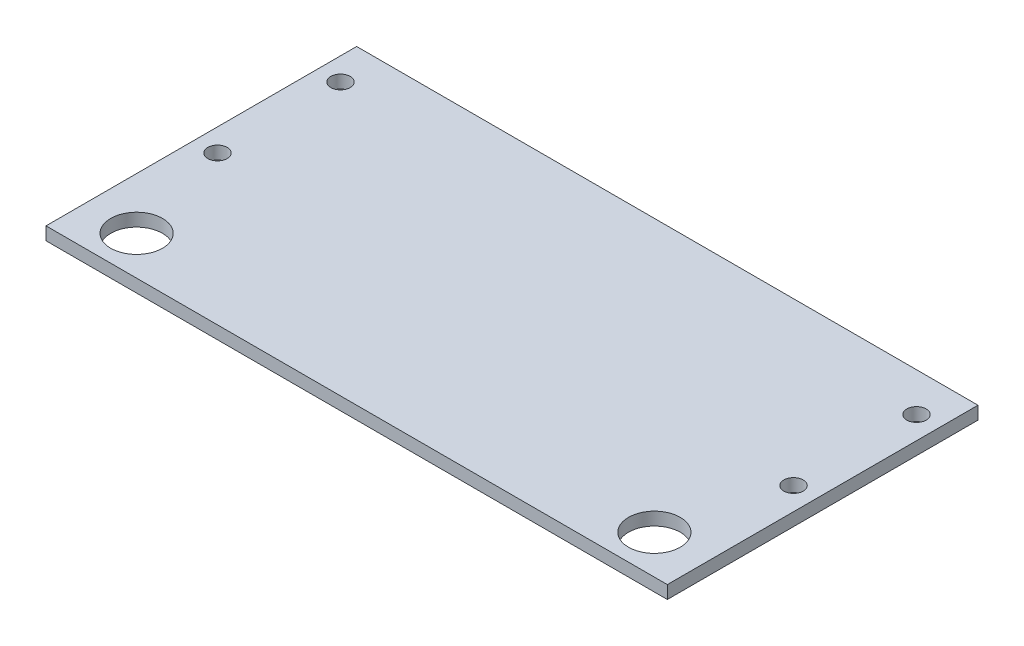
ISO-10303-21;
HEADER;
FILE_DESCRIPTION(('STEP AP214'),'2;1');
FILE_NAME('part.step','',(''),(''),'','','');
FILE_SCHEMA(('AUTOMOTIVE_DESIGN { 1 0 10303 214 1 1 1 1 }'));
ENDSEC;
DATA;
#1=APPLICATION_CONTEXT('core data for automotive mechanical design processes');
#2=APPLICATION_PROTOCOL_DEFINITION('international standard','automotive_design',2000,#1);
#3=PRODUCT_CONTEXT('',#1,'mechanical');
#4=PRODUCT('Part','Part','',(#3));
#5=PRODUCT_RELATED_PRODUCT_CATEGORY('part','',(#4));
#6=PRODUCT_DEFINITION_FORMATION('','',#4);
#7=PRODUCT_DEFINITION_CONTEXT('part definition',#1,'design');
#8=PRODUCT_DEFINITION('design','',#6,#7);
#9=PRODUCT_DEFINITION_SHAPE('','',#8);
#10=(LENGTH_UNIT() NAMED_UNIT(*) SI_UNIT(.MILLI.,.METRE.));
#11=(NAMED_UNIT(*) PLANE_ANGLE_UNIT() SI_UNIT($,.RADIAN.));
#12=(NAMED_UNIT(*) SI_UNIT($,.STERADIAN.) SOLID_ANGLE_UNIT());
#13=UNCERTAINTY_MEASURE_WITH_UNIT(LENGTH_MEASURE(1.E-05),#10,'distance_accuracy_value','');
#14=(GEOMETRIC_REPRESENTATION_CONTEXT(3) GLOBAL_UNCERTAINTY_ASSIGNED_CONTEXT((#13)) GLOBAL_UNIT_ASSIGNED_CONTEXT((#10,
#11,#12)) REPRESENTATION_CONTEXT('',''));
#15=CARTESIAN_POINT('',(0.,0.,0.));
#16=DIRECTION('',(0.,0.,1.));
#17=DIRECTION('',(1.,0.,0.));
#18=AXIS2_PLACEMENT_3D('',#15,#16,#17);
#19=CARTESIAN_POINT('',(0.,6.35,0.));
#20=DIRECTION('',(1.,0.,0.));
#21=DIRECTION('',(0.,0.,-1.));
#22=AXIS2_PLACEMENT_3D('',#19,#20,#21);
#23=PLANE('',#22);
#24=DIRECTION('',(0.,0.,1.));
#25=VECTOR('',#24,1.);
#26=CARTESIAN_POINT('',(0.,0.,0.));
#27=LINE('',#26,#25);
#28=CARTESIAN_POINT('',(0.,0.,-152.4));
#29=VERTEX_POINT('',#28);
#30=CARTESIAN_POINT('',(0.,0.,0.));
#31=VERTEX_POINT('',#30);
#32=EDGE_CURVE('E97',#29,#31,#27,.T.);
#33=ORIENTED_EDGE('',*,*,#32,.T.);
#34=DIRECTION('',(0.,-1.,0.));
#35=VECTOR('',#34,1.);
#36=CARTESIAN_POINT('',(0.,6.35,0.));
#37=LINE('',#36,#35);
#38=CARTESIAN_POINT('',(0.,6.35,0.));
#39=VERTEX_POINT('',#38);
#40=EDGE_CURVE('E11',#39,#31,#37,.T.);
#41=ORIENTED_EDGE('',*,*,#40,.F.);
#42=DIRECTION('',(0.,0.,1.));
#43=VECTOR('',#42,1.);
#44=CARTESIAN_POINT('',(0.,6.35,0.));
#45=LINE('',#44,#43);
#46=CARTESIAN_POINT('',(0.,6.35,-152.4));
#47=VERTEX_POINT('',#46);
#48=EDGE_CURVE('E85',#47,#39,#45,.T.);
#49=ORIENTED_EDGE('',*,*,#48,.F.);
#50=DIRECTION('',(0.,-1.,0.));
#51=VECTOR('',#50,1.);
#52=CARTESIAN_POINT('',(0.,6.35,-152.4));
#53=LINE('',#52,#51);
#54=EDGE_CURVE('E93',#47,#29,#53,.T.);
#55=ORIENTED_EDGE('',*,*,#54,.T.);
#56=EDGE_LOOP('',(#33,#41,#49,#55));
#57=FACE_BOUND('',#56,.T.);
#58=ADVANCED_FACE('F34',(#57),#23,.F.);
#59=CARTESIAN_POINT('',(0.,6.35,0.));
#60=DIRECTION('',(0.,0.,-1.));
#61=DIRECTION('',(-1.,0.,0.));
#62=AXIS2_PLACEMENT_3D('',#59,#60,#61);
#63=PLANE('',#62);
#64=DIRECTION('',(1.,0.,0.));
#65=VECTOR('',#64,1.);
#66=CARTESIAN_POINT('',(0.,0.,0.));
#67=LINE('',#66,#65);
#68=CARTESIAN_POINT('',(304.8,0.,0.));
#69=VERTEX_POINT('',#68);
#70=EDGE_CURVE('E89',#31,#69,#67,.T.);
#71=ORIENTED_EDGE('',*,*,#70,.T.);
#72=DIRECTION('',(0.,-1.,0.));
#73=VECTOR('',#72,1.);
#74=CARTESIAN_POINT('',(304.8,6.35,0.));
#75=LINE('',#74,#73);
#76=CARTESIAN_POINT('',(304.8,6.35,0.));
#77=VERTEX_POINT('',#76);
#78=EDGE_CURVE('E42',#77,#69,#75,.T.);
#79=ORIENTED_EDGE('',*,*,#78,.F.);
#80=DIRECTION('',(1.,0.,0.));
#81=VECTOR('',#80,1.);
#82=CARTESIAN_POINT('',(0.,6.35,0.));
#83=LINE('',#82,#81);
#84=EDGE_CURVE('E80',#39,#77,#83,.T.);
#85=ORIENTED_EDGE('',*,*,#84,.F.);
#86=ORIENTED_EDGE('',*,*,#40,.T.);
#87=EDGE_LOOP('',(#71,#79,#85,#86));
#88=FACE_BOUND('',#87,.T.);
#89=ADVANCED_FACE('F88',(#88),#63,.F.);
#90=CARTESIAN_POINT('',(304.8,6.35,0.));
#91=DIRECTION('',(-1.,0.,0.));
#92=DIRECTION('',(0.,0.,1.));
#93=AXIS2_PLACEMENT_3D('',#90,#91,#92);
#94=PLANE('',#93);
#95=DIRECTION('',(0.,0.,-1.));
#96=VECTOR('',#95,1.);
#97=CARTESIAN_POINT('',(304.8,0.,0.));
#98=LINE('',#97,#96);
#99=CARTESIAN_POINT('',(304.8,0.,-152.4));
#100=VERTEX_POINT('',#99);
#101=EDGE_CURVE('E67',#69,#100,#98,.T.);
#102=ORIENTED_EDGE('',*,*,#101,.T.);
#103=DIRECTION('',(0.,-1.,0.));
#104=VECTOR('',#103,1.);
#105=CARTESIAN_POINT('',(304.8,6.35,-152.4));
#106=LINE('',#105,#104);
#107=CARTESIAN_POINT('',(304.8,6.35,-152.4));
#108=VERTEX_POINT('',#107);
#109=EDGE_CURVE('E90',#108,#100,#106,.T.);
#110=ORIENTED_EDGE('',*,*,#109,.F.);
#111=DIRECTION('',(0.,0.,-1.));
#112=VECTOR('',#111,1.);
#113=CARTESIAN_POINT('',(304.8,6.35,0.));
#114=LINE('',#113,#112);
#115=EDGE_CURVE('E83',#77,#108,#114,.T.);
#116=ORIENTED_EDGE('',*,*,#115,.F.);
#117=ORIENTED_EDGE('',*,*,#78,.T.);
#118=EDGE_LOOP('',(#102,#110,#116,#117));
#119=FACE_BOUND('',#118,.T.);
#120=ADVANCED_FACE('F91',(#119),#94,.F.);
#121=CARTESIAN_POINT('',(0.,6.35,-152.4));
#122=DIRECTION('',(0.,0.,1.));
#123=DIRECTION('',(1.,0.,0.));
#124=AXIS2_PLACEMENT_3D('',#121,#122,#123);
#125=PLANE('',#124);
#126=DIRECTION('',(-1.,0.,0.));
#127=VECTOR('',#126,1.);
#128=CARTESIAN_POINT('',(0.,0.,-152.4));
#129=LINE('',#128,#127);
#130=EDGE_CURVE('E73',#100,#29,#129,.T.);
#131=ORIENTED_EDGE('',*,*,#130,.T.);
#132=ORIENTED_EDGE('',*,*,#54,.F.);
#133=DIRECTION('',(-1.,0.,0.));
#134=VECTOR('',#133,1.);
#135=CARTESIAN_POINT('',(0.,6.35,-152.4));
#136=LINE('',#135,#134);
#137=EDGE_CURVE('E50',#108,#47,#136,.T.);
#138=ORIENTED_EDGE('',*,*,#137,.F.);
#139=ORIENTED_EDGE('',*,*,#109,.T.);
#140=EDGE_LOOP('',(#131,#132,#138,#139));
#141=FACE_BOUND('',#140,.T.);
#142=ADVANCED_FACE('F105',(#141),#125,.F.);
#143=CARTESIAN_POINT('',(0.,6.35,-152.4));
#144=DIRECTION('',(0.,-1.,0.));
#145=DIRECTION('',(0.,0.,-1.));
#146=AXIS2_PLACEMENT_3D('',#143,#144,#145);
#147=PLANE('',#146);
#148=CARTESIAN_POINT('',(279.4,6.35,-19.0499999999999));
#149=DIRECTION('',(0.,1.,0.));
#150=DIRECTION('',(0.,0.,-1.));
#151=AXIS2_PLACEMENT_3D('',#148,#149,#150);
#152=CIRCLE('',#151,12.7);
#153=CARTESIAN_POINT('',(279.4,6.35,-31.7499999999999));
#154=VERTEX_POINT('',#153);
#155=EDGE_CURVE('E138',#154,#154,#152,.T.);
#156=ORIENTED_EDGE('',*,*,#155,.F.);
#157=EDGE_LOOP('',(#156));
#158=FACE_BOUND('',#157,.T.);
#159=CARTESIAN_POINT('',(293.6875,6.35,-73.025));
#160=DIRECTION('',(0.,1.,0.));
#161=DIRECTION('',(0.,0.,-1.));
#162=AXIS2_PLACEMENT_3D('',#159,#160,#161);
#163=CIRCLE('',#162,4.76250000000001);
#164=CARTESIAN_POINT('',(293.6875,6.35,-77.7875));
#165=VERTEX_POINT('',#164);
#166=EDGE_CURVE('E132',#165,#165,#163,.T.);
#167=ORIENTED_EDGE('',*,*,#166,.F.);
#168=EDGE_LOOP('',(#167));
#169=FACE_BOUND('',#168,.T.);
#170=CARTESIAN_POINT('',(293.6875,6.35,-133.35));
#171=DIRECTION('',(0.,1.,0.));
#172=DIRECTION('',(0.,0.,-1.));
#173=AXIS2_PLACEMENT_3D('',#170,#171,#172);
#174=CIRCLE('',#173,4.76250000000001);
#175=CARTESIAN_POINT('',(293.6875,6.35,-138.1125));
#176=VERTEX_POINT('',#175);
#177=EDGE_CURVE('E126',#176,#176,#174,.T.);
#178=ORIENTED_EDGE('',*,*,#177,.F.);
#179=EDGE_LOOP('',(#178));
#180=FACE_BOUND('',#179,.T.);
#181=CARTESIAN_POINT('',(11.1125,6.35,-73.025));
#182=DIRECTION('',(0.,1.,0.));
#183=DIRECTION('',(0.,0.,1.));
#184=AXIS2_PLACEMENT_3D('',#181,#182,#183);
#185=CIRCLE('',#184,4.7625);
#186=CARTESIAN_POINT('',(11.1125,6.35,-68.2625));
#187=VERTEX_POINT('',#186);
#188=EDGE_CURVE('E120',#187,#187,#185,.T.);
#189=ORIENTED_EDGE('',*,*,#188,.F.);
#190=EDGE_LOOP('',(#189));
#191=FACE_BOUND('',#190,.T.);
#192=CARTESIAN_POINT('',(11.1125,6.35,-133.35));
#193=DIRECTION('',(0.,1.,0.));
#194=DIRECTION('',(0.,0.,1.));
#195=AXIS2_PLACEMENT_3D('',#192,#193,#194);
#196=CIRCLE('',#195,4.7625);
#197=CARTESIAN_POINT('',(11.1125,6.35,-128.5875));
#198=VERTEX_POINT('',#197);
#199=EDGE_CURVE('E114',#198,#198,#196,.T.);
#200=ORIENTED_EDGE('',*,*,#199,.F.);
#201=EDGE_LOOP('',(#200));
#202=FACE_BOUND('',#201,.T.);
#203=CARTESIAN_POINT('',(25.4,6.35,-19.05));
#204=DIRECTION('',(0.,1.,0.));
#205=DIRECTION('',(0.,0.,1.));
#206=AXIS2_PLACEMENT_3D('',#203,#204,#205);
#207=CIRCLE('',#206,12.7);
#208=CARTESIAN_POINT('',(25.4,6.35,-6.35));
#209=VERTEX_POINT('',#208);
#210=EDGE_CURVE('E100',#209,#209,#207,.T.);
#211=ORIENTED_EDGE('',*,*,#210,.F.);
#212=EDGE_LOOP('',(#211));
#213=FACE_BOUND('',#212,.T.);
#214=ORIENTED_EDGE('',*,*,#48,.T.);
#215=ORIENTED_EDGE('',*,*,#84,.T.);
#216=ORIENTED_EDGE('',*,*,#115,.T.);
#217=ORIENTED_EDGE('',*,*,#137,.T.);
#218=EDGE_LOOP('',(#214,#215,#216,#217));
#219=FACE_BOUND('',#218,.T.);
#220=ADVANCED_FACE('F81',(#158,#169,#180,#191,#202,#213,#219),#147,.F.);
#221=CARTESIAN_POINT('',(0.,0.,-152.4));
#222=DIRECTION('',(0.,-1.,0.));
#223=DIRECTION('',(0.,0.,-1.));
#224=AXIS2_PLACEMENT_3D('',#221,#222,#223);
#225=PLANE('',#224);
#226=CARTESIAN_POINT('',(279.4,0.,-19.0499999999999));
#227=DIRECTION('',(0.,-1.,0.));
#228=DIRECTION('',(0.,0.,-1.));
#229=AXIS2_PLACEMENT_3D('',#226,#227,#228);
#230=CIRCLE('',#229,12.7);
#231=CARTESIAN_POINT('',(279.4,0.,-31.7499999999999));
#232=VERTEX_POINT('',#231);
#233=EDGE_CURVE('E141',#232,#232,#230,.F.);
#234=ORIENTED_EDGE('',*,*,#233,.T.);
#235=EDGE_LOOP('',(#234));
#236=FACE_BOUND('',#235,.T.);
#237=CARTESIAN_POINT('',(293.6875,0.,-73.025));
#238=DIRECTION('',(0.,-1.,0.));
#239=DIRECTION('',(0.,0.,-1.));
#240=AXIS2_PLACEMENT_3D('',#237,#238,#239);
#241=CIRCLE('',#240,4.76250000000001);
#242=CARTESIAN_POINT('',(293.6875,0.,-77.7875));
#243=VERTEX_POINT('',#242);
#244=EDGE_CURVE('E135',#243,#243,#241,.F.);
#245=ORIENTED_EDGE('',*,*,#244,.T.);
#246=EDGE_LOOP('',(#245));
#247=FACE_BOUND('',#246,.T.);
#248=CARTESIAN_POINT('',(293.6875,0.,-133.35));
#249=DIRECTION('',(0.,-1.,0.));
#250=DIRECTION('',(0.,0.,-1.));
#251=AXIS2_PLACEMENT_3D('',#248,#249,#250);
#252=CIRCLE('',#251,4.76250000000001);
#253=CARTESIAN_POINT('',(293.6875,0.,-138.1125));
#254=VERTEX_POINT('',#253);
#255=EDGE_CURVE('E129',#254,#254,#252,.F.);
#256=ORIENTED_EDGE('',*,*,#255,.T.);
#257=EDGE_LOOP('',(#256));
#258=FACE_BOUND('',#257,.T.);
#259=CARTESIAN_POINT('',(11.1125,0.,-73.025));
#260=DIRECTION('',(0.,-1.,0.));
#261=DIRECTION('',(0.,0.,-1.));
#262=AXIS2_PLACEMENT_3D('',#259,#260,#261);
#263=CIRCLE('',#262,4.7625);
#264=CARTESIAN_POINT('',(11.1125,0.,-77.7875));
#265=VERTEX_POINT('',#264);
#266=EDGE_CURVE('E123',#265,#265,#263,.F.);
#267=ORIENTED_EDGE('',*,*,#266,.T.);
#268=EDGE_LOOP('',(#267));
#269=FACE_BOUND('',#268,.T.);
#270=CARTESIAN_POINT('',(11.1125,0.,-133.35));
#271=DIRECTION('',(0.,-1.,0.));
#272=DIRECTION('',(0.,0.,-1.));
#273=AXIS2_PLACEMENT_3D('',#270,#271,#272);
#274=CIRCLE('',#273,4.7625);
#275=CARTESIAN_POINT('',(11.1125,0.,-138.1125));
#276=VERTEX_POINT('',#275);
#277=EDGE_CURVE('E117',#276,#276,#274,.F.);
#278=ORIENTED_EDGE('',*,*,#277,.T.);
#279=EDGE_LOOP('',(#278));
#280=FACE_BOUND('',#279,.T.);
#281=CARTESIAN_POINT('',(25.4,0.,-19.05));
#282=DIRECTION('',(0.,-1.,0.));
#283=DIRECTION('',(0.,0.,-1.));
#284=AXIS2_PLACEMENT_3D('',#281,#282,#283);
#285=CIRCLE('',#284,12.7);
#286=CARTESIAN_POINT('',(25.4,0.,-31.75));
#287=VERTEX_POINT('',#286);
#288=EDGE_CURVE('E111',#287,#287,#285,.F.);
#289=ORIENTED_EDGE('',*,*,#288,.T.);
#290=EDGE_LOOP('',(#289));
#291=FACE_BOUND('',#290,.T.);
#292=ORIENTED_EDGE('',*,*,#32,.F.);
#293=ORIENTED_EDGE('',*,*,#130,.F.);
#294=ORIENTED_EDGE('',*,*,#101,.F.);
#295=ORIENTED_EDGE('',*,*,#70,.F.);
#296=EDGE_LOOP('',(#292,#293,#294,#295));
#297=FACE_BOUND('',#296,.T.);
#298=ADVANCED_FACE('F108',(#236,#247,#258,#269,#280,#291,#297),#225,.T.);
#299=CARTESIAN_POINT('',(25.4,-0.00100000000000013,-19.05));
#300=DIRECTION('',(0.,1.,0.));
#301=DIRECTION('',(0.,0.,1.));
#302=AXIS2_PLACEMENT_3D('',#299,#300,#301);
#303=CYLINDRICAL_SURFACE('',#302,12.7);
#304=ORIENTED_EDGE('',*,*,#288,.F.);
#305=EDGE_LOOP('',(#304));
#306=FACE_BOUND('',#305,.T.);
#307=ORIENTED_EDGE('',*,*,#210,.T.);
#308=EDGE_LOOP('',(#307));
#309=FACE_BOUND('',#308,.T.);
#310=ADVANCED_FACE('F162',(#306,#309),#303,.F.);
#311=CARTESIAN_POINT('',(11.1125,-0.00100000000000013,-133.35));
#312=DIRECTION('',(0.,1.,0.));
#313=DIRECTION('',(0.,0.,1.));
#314=AXIS2_PLACEMENT_3D('',#311,#312,#313);
#315=CYLINDRICAL_SURFACE('',#314,4.7625);
#316=ORIENTED_EDGE('',*,*,#277,.F.);
#317=EDGE_LOOP('',(#316));
#318=FACE_BOUND('',#317,.T.);
#319=ORIENTED_EDGE('',*,*,#199,.T.);
#320=EDGE_LOOP('',(#319));
#321=FACE_BOUND('',#320,.T.);
#322=ADVANCED_FACE('F164',(#318,#321),#315,.F.);
#323=CARTESIAN_POINT('',(11.1125,-0.00100000000000013,-73.025));
#324=DIRECTION('',(0.,1.,0.));
#325=DIRECTION('',(0.,0.,1.));
#326=AXIS2_PLACEMENT_3D('',#323,#324,#325);
#327=CYLINDRICAL_SURFACE('',#326,4.7625);
#328=ORIENTED_EDGE('',*,*,#266,.F.);
#329=EDGE_LOOP('',(#328));
#330=FACE_BOUND('',#329,.T.);
#331=ORIENTED_EDGE('',*,*,#188,.T.);
#332=EDGE_LOOP('',(#331));
#333=FACE_BOUND('',#332,.T.);
#334=ADVANCED_FACE('F171',(#330,#333),#327,.F.);
#335=CARTESIAN_POINT('',(293.6875,-0.00100000000000013,-133.35));
#336=DIRECTION('',(0.,1.,0.));
#337=DIRECTION('',(0.,0.,1.));
#338=AXIS2_PLACEMENT_3D('',#335,#336,#337);
#339=CYLINDRICAL_SURFACE('',#338,4.76250000000001);
#340=ORIENTED_EDGE('',*,*,#255,.F.);
#341=EDGE_LOOP('',(#340));
#342=FACE_BOUND('',#341,.T.);
#343=ORIENTED_EDGE('',*,*,#177,.T.);
#344=EDGE_LOOP('',(#343));
#345=FACE_BOUND('',#344,.T.);
#346=ADVANCED_FACE('F218',(#342,#345),#339,.F.);
#347=CARTESIAN_POINT('',(293.6875,-0.00100000000000013,-73.025));
#348=DIRECTION('',(0.,1.,0.));
#349=DIRECTION('',(0.,0.,1.));
#350=AXIS2_PLACEMENT_3D('',#347,#348,#349);
#351=CYLINDRICAL_SURFACE('',#350,4.76250000000001);
#352=ORIENTED_EDGE('',*,*,#244,.F.);
#353=EDGE_LOOP('',(#352));
#354=FACE_BOUND('',#353,.T.);
#355=ORIENTED_EDGE('',*,*,#166,.T.);
#356=EDGE_LOOP('',(#355));
#357=FACE_BOUND('',#356,.T.);
#358=ADVANCED_FACE('F228',(#354,#357),#351,.F.);
#359=CARTESIAN_POINT('',(279.4,-0.00100000000000013,-19.0499999999999));
#360=DIRECTION('',(0.,1.,0.));
#361=DIRECTION('',(0.,0.,1.));
#362=AXIS2_PLACEMENT_3D('',#359,#360,#361);
#363=CYLINDRICAL_SURFACE('',#362,12.7);
#364=ORIENTED_EDGE('',*,*,#233,.F.);
#365=EDGE_LOOP('',(#364));
#366=FACE_BOUND('',#365,.T.);
#367=ORIENTED_EDGE('',*,*,#155,.T.);
#368=EDGE_LOOP('',(#367));
#369=FACE_BOUND('',#368,.T.);
#370=ADVANCED_FACE('F147',(#366,#369),#363,.F.);
#371=CLOSED_SHELL('',(#58,#89,#120,#142,#220,#298,#310,#322,#334,#346,#358,#370));
#372=MANIFOLD_SOLID_BREP('B2',#371);
#373=ADVANCED_BREP_SHAPE_REPRESENTATION('',(#18,#372),#14);
#374=SHAPE_DEFINITION_REPRESENTATION(#9,#373);
ENDSEC;
END-ISO-10303-21;
